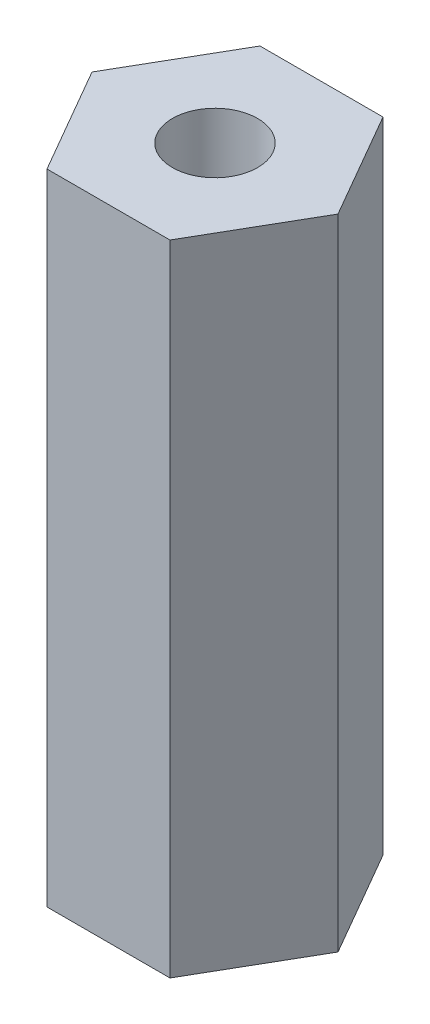
ISO-10303-21;
HEADER;
FILE_DESCRIPTION(('STEP AP214'),'2;1');
FILE_NAME('part.step','',(''),(''),'','','');
FILE_SCHEMA(('AUTOMOTIVE_DESIGN { 1 0 10303 214 1 1 1 1 }'));
ENDSEC;
DATA;
#1=APPLICATION_CONTEXT('core data for automotive mechanical design processes');
#2=APPLICATION_PROTOCOL_DEFINITION('international standard','automotive_design',2000,#1);
#3=PRODUCT_CONTEXT('',#1,'mechanical');
#4=PRODUCT('Part','Part','',(#3));
#5=PRODUCT_RELATED_PRODUCT_CATEGORY('part','',(#4));
#6=PRODUCT_DEFINITION_FORMATION('','',#4);
#7=PRODUCT_DEFINITION_CONTEXT('part definition',#1,'design');
#8=PRODUCT_DEFINITION('design','',#6,#7);
#9=PRODUCT_DEFINITION_SHAPE('','',#8);
#10=(LENGTH_UNIT() NAMED_UNIT(*) SI_UNIT(.MILLI.,.METRE.));
#11=(NAMED_UNIT(*) PLANE_ANGLE_UNIT() SI_UNIT($,.RADIAN.));
#12=(NAMED_UNIT(*) SI_UNIT($,.STERADIAN.) SOLID_ANGLE_UNIT());
#13=UNCERTAINTY_MEASURE_WITH_UNIT(LENGTH_MEASURE(1.E-05),#10,'distance_accuracy_value','');
#14=(GEOMETRIC_REPRESENTATION_CONTEXT(3) GLOBAL_UNCERTAINTY_ASSIGNED_CONTEXT((#13)) GLOBAL_UNIT_ASSIGNED_CONTEXT((#10,
#11,#12)) REPRESENTATION_CONTEXT('',''));
#15=CARTESIAN_POINT('',(0.,0.,0.));
#16=DIRECTION('',(0.,0.,1.));
#17=DIRECTION('',(1.,0.,0.));
#18=AXIS2_PLACEMENT_3D('',#15,#16,#17);
#19=CARTESIAN_POINT('',(1.443375673,15.,2.5));
#20=DIRECTION('',(-0.866025403838329,0.,-0.499999999906659));
#21=DIRECTION('',(-0.499999999906659,0.,0.866025403838329));
#22=AXIS2_PLACEMENT_3D('',#19,#20,#21);
#23=PLANE('',#22);
#24=DIRECTION('',(0.500000000006738,0.,-0.866025403780548));
#25=VECTOR('',#24,1.);
#26=CARTESIAN_POINT('',(1.443375673,15.,2.5));
#27=LINE('',#26,#25);
#28=CARTESIAN_POINT('',(1.443375673,15.,2.5));
#29=VERTEX_POINT('',#28);
#30=CARTESIAN_POINT('',(2.88675134585555,15.,-8.33995045868235E-11));
#31=VERTEX_POINT('',#30);
#32=EDGE_CURVE('E65',#29,#31,#27,.T.);
#33=ORIENTED_EDGE('',*,*,#32,.F.);
#34=DIRECTION('',(0.,1.,0.));
#35=VECTOR('',#34,1.);
#36=CARTESIAN_POINT('',(1.443375673,15.,2.5));
#37=LINE('',#36,#35);
#38=CARTESIAN_POINT('',(1.443375673,0.,2.5));
#39=VERTEX_POINT('',#38);
#40=EDGE_CURVE('E97',#39,#29,#37,.T.);
#41=ORIENTED_EDGE('',*,*,#40,.F.);
#42=DIRECTION('',(-0.500000000006738,0.,0.866025403780548));
#43=VECTOR('',#42,1.);
#44=CARTESIAN_POINT('',(2.886751346,0.,0.));
#45=LINE('',#44,#43);
#46=CARTESIAN_POINT('',(2.88675134585555,0.,-8.33993789826903E-11));
#47=VERTEX_POINT('',#46);
#48=EDGE_CURVE('E71',#47,#39,#45,.T.);
#49=ORIENTED_EDGE('',*,*,#48,.F.);
#50=DIRECTION('',(0.,1.,0.));
#51=VECTOR('',#50,1.);
#52=CARTESIAN_POINT('',(2.886751346,15.,0.));
#53=LINE('',#52,#51);
#54=EDGE_CURVE('E68',#31,#47,#53,.F.);
#55=ORIENTED_EDGE('',*,*,#54,.F.);
#56=EDGE_LOOP('',(#33,#41,#49,#55));
#57=FACE_BOUND('',#56,.T.);
#58=ADVANCED_FACE('F17',(#57),#23,.F.);
#59=CARTESIAN_POINT('',(-1.443375673,15.,2.5));
#60=DIRECTION('',(0.,0.,-1.));
#61=DIRECTION('',(-1.,0.,0.));
#62=AXIS2_PLACEMENT_3D('',#59,#60,#61);
#63=PLANE('',#62);
#64=DIRECTION('',(1.,0.,0.));
#65=VECTOR('',#64,1.);
#66=CARTESIAN_POINT('',(0.,15.,2.5));
#67=LINE('',#66,#65);
#68=CARTESIAN_POINT('',(-1.44337567314445,15.,2.5000000000834));
#69=VERTEX_POINT('',#68);
#70=EDGE_CURVE('E86',#69,#29,#67,.T.);
#71=ORIENTED_EDGE('',*,*,#70,.F.);
#72=DIRECTION('',(0.,1.,0.));
#73=VECTOR('',#72,1.);
#74=CARTESIAN_POINT('',(-1.4433756732889,15.,2.5000000001668));
#75=LINE('',#74,#73);
#76=CARTESIAN_POINT('',(-1.44337567307223,0.,2.5000000000417));
#77=VERTEX_POINT('',#76);
#78=EDGE_CURVE('E95',#77,#69,#75,.T.);
#79=ORIENTED_EDGE('',*,*,#78,.F.);
#80=DIRECTION('',(1.,0.,0.));
#81=VECTOR('',#80,1.);
#82=CARTESIAN_POINT('',(0.,0.,2.5));
#83=LINE('',#82,#81);
#84=EDGE_CURVE('E102',#39,#77,#83,.F.);
#85=ORIENTED_EDGE('',*,*,#84,.F.);
#86=ORIENTED_EDGE('',*,*,#40,.T.);
#87=EDGE_LOOP('',(#71,#79,#85,#86));
#88=FACE_BOUND('',#87,.T.);
#89=ADVANCED_FACE('F100',(#88),#63,.F.);
#90=CARTESIAN_POINT('',(-2.886751346,15.,0.));
#91=DIRECTION('',(0.866025403838329,0.,-0.499999999906659));
#92=DIRECTION('',(-0.499999999906659,0.,-0.866025403838329));
#93=AXIS2_PLACEMENT_3D('',#90,#91,#92);
#94=PLANE('',#93);
#95=DIRECTION('',(0.500000000006738,0.,0.866025403780548));
#96=VECTOR('',#95,1.);
#97=CARTESIAN_POINT('',(-2.886751346,15.,0.));
#98=LINE('',#97,#96);
#99=CARTESIAN_POINT('',(-2.88675134585555,15.,8.33995045868235E-11));
#100=VERTEX_POINT('',#99);
#101=EDGE_CURVE('E112',#100,#69,#98,.T.);
#102=ORIENTED_EDGE('',*,*,#101,.F.);
#103=DIRECTION('',(0.,1.,0.));
#104=VECTOR('',#103,1.);
#105=CARTESIAN_POINT('',(-2.8867513457111,15.,1.66798866385598E-10));
#106=LINE('',#105,#104);
#107=CARTESIAN_POINT('',(-2.88675134592777,0.,4.16996623862909E-11));
#108=VERTEX_POINT('',#107);
#109=EDGE_CURVE('E93',#108,#100,#106,.T.);
#110=ORIENTED_EDGE('',*,*,#109,.F.);
#111=DIRECTION('',(-0.500000000006738,0.,-0.866025403780548));
#112=VECTOR('',#111,1.);
#113=CARTESIAN_POINT('',(-1.443375673,0.,2.5));
#114=LINE('',#113,#112);
#115=EDGE_CURVE('E106',#77,#108,#114,.T.);
#116=ORIENTED_EDGE('',*,*,#115,.F.);
#117=ORIENTED_EDGE('',*,*,#78,.T.);
#118=EDGE_LOOP('',(#102,#110,#116,#117));
#119=FACE_BOUND('',#118,.T.);
#120=ADVANCED_FACE('F129',(#119),#94,.F.);
#121=CARTESIAN_POINT('',(-1.443375673,15.,-2.5));
#122=DIRECTION('',(0.866025403838329,0.,0.499999999906659));
#123=DIRECTION('',(0.499999999906659,0.,-0.866025403838329));
#124=AXIS2_PLACEMENT_3D('',#121,#122,#123);
#125=PLANE('',#124);
#126=DIRECTION('',(-0.500000000006738,0.,0.866025403780548));
#127=VECTOR('',#126,1.);
#128=CARTESIAN_POINT('',(-1.443375673,15.,-2.5));
#129=LINE('',#128,#127);
#130=CARTESIAN_POINT('',(-1.443375673,15.,-2.5));
#131=VERTEX_POINT('',#130);
#132=EDGE_CURVE('E117',#131,#100,#129,.T.);
#133=ORIENTED_EDGE('',*,*,#132,.F.);
#134=DIRECTION('',(0.,1.,0.));
#135=VECTOR('',#134,1.);
#136=CARTESIAN_POINT('',(-1.443375673,15.,-2.5));
#137=LINE('',#136,#135);
#138=CARTESIAN_POINT('',(-1.443375673,0.,-2.5));
#139=VERTEX_POINT('',#138);
#140=EDGE_CURVE('E91',#139,#131,#137,.T.);
#141=ORIENTED_EDGE('',*,*,#140,.F.);
#142=DIRECTION('',(0.500000000006738,0.,-0.866025403780548));
#143=VECTOR('',#142,1.);
#144=CARTESIAN_POINT('',(-2.886751346,0.,0.));
#145=LINE('',#144,#143);
#146=EDGE_CURVE('E127',#108,#139,#145,.T.);
#147=ORIENTED_EDGE('',*,*,#146,.F.);
#148=ORIENTED_EDGE('',*,*,#109,.T.);
#149=EDGE_LOOP('',(#133,#141,#147,#148));
#150=FACE_BOUND('',#149,.T.);
#151=ADVANCED_FACE('F125',(#150),#125,.F.);
#152=CARTESIAN_POINT('',(1.443375673,15.,-2.5));
#153=DIRECTION('',(0.,0.,1.));
#154=DIRECTION('',(1.,0.,0.));
#155=AXIS2_PLACEMENT_3D('',#152,#153,#154);
#156=PLANE('',#155);
#157=DIRECTION('',(1.,0.,0.));
#158=VECTOR('',#157,1.);
#159=CARTESIAN_POINT('',(0.,15.,-2.5));
#160=LINE('',#159,#158);
#161=CARTESIAN_POINT('',(1.44337567314445,15.,-2.5000000000834));
#162=VERTEX_POINT('',#161);
#163=EDGE_CURVE('E80',#162,#131,#160,.F.);
#164=ORIENTED_EDGE('',*,*,#163,.F.);
#165=DIRECTION('',(0.,1.,0.));
#166=VECTOR('',#165,1.);
#167=CARTESIAN_POINT('',(1.4433756732889,15.,-2.5000000001668));
#168=LINE('',#167,#166);
#169=CARTESIAN_POINT('',(1.44337567307223,0.,-2.5000000000417));
#170=VERTEX_POINT('',#169);
#171=EDGE_CURVE('E33',#170,#162,#168,.T.);
#172=ORIENTED_EDGE('',*,*,#171,.F.);
#173=DIRECTION('',(1.,0.,0.));
#174=VECTOR('',#173,1.);
#175=CARTESIAN_POINT('',(0.,0.,-2.5));
#176=LINE('',#175,#174);
#177=EDGE_CURVE('E121',#139,#170,#176,.T.);
#178=ORIENTED_EDGE('',*,*,#177,.F.);
#179=ORIENTED_EDGE('',*,*,#140,.T.);
#180=EDGE_LOOP('',(#164,#172,#178,#179));
#181=FACE_BOUND('',#180,.T.);
#182=ADVANCED_FACE('F120',(#181),#156,.F.);
#183=CARTESIAN_POINT('',(2.886751346,15.,0.));
#184=DIRECTION('',(-0.866025403838329,0.,0.499999999906659));
#185=DIRECTION('',(0.499999999906659,0.,0.866025403838329));
#186=AXIS2_PLACEMENT_3D('',#183,#184,#185);
#187=PLANE('',#186);
#188=DIRECTION('',(-0.500000000006738,0.,-0.866025403780548));
#189=VECTOR('',#188,1.);
#190=CARTESIAN_POINT('',(2.886751346,15.,0.));
#191=LINE('',#190,#189);
#192=EDGE_CURVE('E76',#31,#162,#191,.T.);
#193=ORIENTED_EDGE('',*,*,#192,.F.);
#194=ORIENTED_EDGE('',*,*,#54,.T.);
#195=DIRECTION('',(0.500000000006738,0.,0.866025403780548));
#196=VECTOR('',#195,1.);
#197=CARTESIAN_POINT('',(1.443375673,0.,-2.5));
#198=LINE('',#197,#196);
#199=EDGE_CURVE('E110',#170,#47,#198,.T.);
#200=ORIENTED_EDGE('',*,*,#199,.F.);
#201=ORIENTED_EDGE('',*,*,#171,.T.);
#202=EDGE_LOOP('',(#193,#194,#200,#201));
#203=FACE_BOUND('',#202,.T.);
#204=ADVANCED_FACE('F77',(#203),#187,.F.);
#205=CARTESIAN_POINT('',(0.,15.,0.));
#206=DIRECTION('',(0.,1.,0.));
#207=DIRECTION('',(0.,0.,1.));
#208=AXIS2_PLACEMENT_3D('',#205,#206,#207);
#209=PLANE('',#208);
#210=CARTESIAN_POINT('',(0.,15.,0.));
#211=DIRECTION('',(0.,-1.,0.));
#212=DIRECTION('',(1.,0.,0.));
#213=AXIS2_PLACEMENT_3D('',#210,#211,#212);
#214=CIRCLE('',#213,1.);
#215=CARTESIAN_POINT('',(1.,15.,0.));
#216=VERTEX_POINT('',#215);
#217=EDGE_CURVE('E20',#216,#216,#214,.F.);
#218=ORIENTED_EDGE('',*,*,#217,.F.);
#219=EDGE_LOOP('',(#218));
#220=FACE_BOUND('',#219,.T.);
#221=ORIENTED_EDGE('',*,*,#101,.T.);
#222=ORIENTED_EDGE('',*,*,#70,.T.);
#223=ORIENTED_EDGE('',*,*,#32,.T.);
#224=ORIENTED_EDGE('',*,*,#192,.T.);
#225=ORIENTED_EDGE('',*,*,#163,.T.);
#226=ORIENTED_EDGE('',*,*,#132,.T.);
#227=EDGE_LOOP('',(#221,#222,#223,#224,#225,#226));
#228=FACE_BOUND('',#227,.T.);
#229=ADVANCED_FACE('F84',(#220,#228),#209,.T.);
#230=CARTESIAN_POINT('',(0.,0.,0.));
#231=DIRECTION('',(0.,1.,0.));
#232=DIRECTION('',(0.,0.,1.));
#233=AXIS2_PLACEMENT_3D('',#230,#231,#232);
#234=PLANE('',#233);
#235=CARTESIAN_POINT('',(0.,0.,0.));
#236=DIRECTION('',(0.,-1.,0.));
#237=DIRECTION('',(1.,0.,0.));
#238=AXIS2_PLACEMENT_3D('',#235,#236,#237);
#239=CIRCLE('',#238,1.);
#240=CARTESIAN_POINT('',(0.999999999999987,0.,0.));
#241=VERTEX_POINT('',#240);
#242=EDGE_CURVE('E11',#241,#241,#239,.T.);
#243=ORIENTED_EDGE('',*,*,#242,.F.);
#244=EDGE_LOOP('',(#243));
#245=FACE_BOUND('',#244,.T.);
#246=ORIENTED_EDGE('',*,*,#177,.T.);
#247=ORIENTED_EDGE('',*,*,#199,.T.);
#248=ORIENTED_EDGE('',*,*,#48,.T.);
#249=ORIENTED_EDGE('',*,*,#84,.T.);
#250=ORIENTED_EDGE('',*,*,#115,.T.);
#251=ORIENTED_EDGE('',*,*,#146,.T.);
#252=EDGE_LOOP('',(#246,#247,#248,#249,#250,#251));
#253=FACE_BOUND('',#252,.T.);
#254=ADVANCED_FACE('F109',(#245,#253),#234,.F.);
#255=CARTESIAN_POINT('',(0.,15.,0.));
#256=DIRECTION('',(0.,-1.,0.));
#257=DIRECTION('',(1.,0.,0.));
#258=AXIS2_PLACEMENT_3D('',#255,#256,#257);
#259=CYLINDRICAL_SURFACE('',#258,1.);
#260=ORIENTED_EDGE('',*,*,#242,.T.);
#261=EDGE_LOOP('',(#260));
#262=FACE_BOUND('',#261,.T.);
#263=ORIENTED_EDGE('',*,*,#217,.T.);
#264=EDGE_LOOP('',(#263));
#265=FACE_BOUND('',#264,.T.);
#266=ADVANCED_FACE('F136',(#262,#265),#259,.F.);
#267=CLOSED_SHELL('',(#58,#89,#120,#151,#182,#204,#229,#254,#266));
#268=MANIFOLD_SOLID_BREP('B1',#267);
#269=ADVANCED_BREP_SHAPE_REPRESENTATION('',(#18,#268),#14);
#270=SHAPE_DEFINITION_REPRESENTATION(#9,#269);
ENDSEC;
END-ISO-10303-21;
